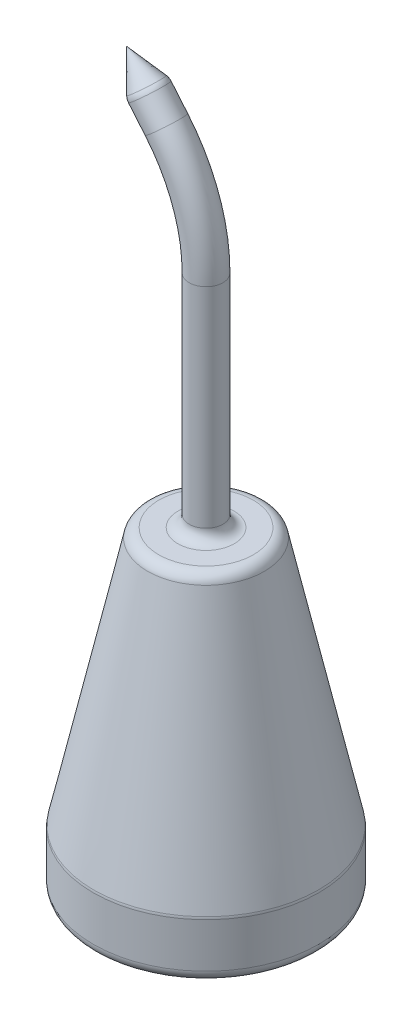
ISO-10303-21;
HEADER;
FILE_DESCRIPTION(('STEP AP214'),'2;1');
FILE_NAME('part.step','',(''),(''),'','','');
FILE_SCHEMA(('AUTOMOTIVE_DESIGN { 1 0 10303 214 1 1 1 1 }'));
ENDSEC;
DATA;
#1=APPLICATION_CONTEXT('core data for automotive mechanical design processes');
#2=APPLICATION_PROTOCOL_DEFINITION('international standard','automotive_design',2000,#1);
#3=PRODUCT_CONTEXT('',#1,'mechanical');
#4=PRODUCT('Part','Part','',(#3));
#5=PRODUCT_RELATED_PRODUCT_CATEGORY('part','',(#4));
#6=PRODUCT_DEFINITION_FORMATION('','',#4);
#7=PRODUCT_DEFINITION_CONTEXT('part definition',#1,'design');
#8=PRODUCT_DEFINITION('design','',#6,#7);
#9=PRODUCT_DEFINITION_SHAPE('','',#8);
#10=(LENGTH_UNIT() NAMED_UNIT(*) SI_UNIT(.MILLI.,.METRE.));
#11=(NAMED_UNIT(*) PLANE_ANGLE_UNIT() SI_UNIT($,.RADIAN.));
#12=(NAMED_UNIT(*) SI_UNIT($,.STERADIAN.) SOLID_ANGLE_UNIT());
#13=UNCERTAINTY_MEASURE_WITH_UNIT(LENGTH_MEASURE(1.E-05),#10,'distance_accuracy_value','');
#14=(GEOMETRIC_REPRESENTATION_CONTEXT(3) GLOBAL_UNCERTAINTY_ASSIGNED_CONTEXT((#13)) GLOBAL_UNIT_ASSIGNED_CONTEXT((#10,
#11,#12)) REPRESENTATION_CONTEXT('',''));
#15=CARTESIAN_POINT('',(0.,0.,0.));
#16=DIRECTION('',(0.,0.,1.));
#17=DIRECTION('',(1.,0.,0.));
#18=AXIS2_PLACEMENT_3D('',#15,#16,#17);
#19=CARTESIAN_POINT('',(0.,42.,0.));
#20=DIRECTION('',(0.,1.,0.));
#21=DIRECTION('',(0.,0.,1.));
#22=AXIS2_PLACEMENT_3D('',#19,#20,#21);
#23=CYLINDRICAL_SURFACE('',#22,10.);
#24=CARTESIAN_POINT('',(0.,0.,0.));
#25=DIRECTION('',(0.,1.,0.));
#26=DIRECTION('',(0.,0.,1.));
#27=AXIS2_PLACEMENT_3D('',#24,#25,#26);
#28=CIRCLE('',#27,10.);
#29=CARTESIAN_POINT('',(0.,0.,10.));
#30=VERTEX_POINT('',#29);
#31=EDGE_CURVE('E155',#30,#30,#28,.T.);
#32=ORIENTED_EDGE('',*,*,#31,.F.);
#33=EDGE_LOOP('',(#32));
#34=FACE_BOUND('',#33,.T.);
#35=CARTESIAN_POINT('',(0.,30.,0.));
#36=DIRECTION('',(0.,1.,0.));
#37=DIRECTION('',(0.,0.,1.));
#38=AXIS2_PLACEMENT_3D('',#35,#36,#37);
#39=CIRCLE('',#38,10.);
#40=CARTESIAN_POINT('',(0.,30.,10.));
#41=VERTEX_POINT('',#40);
#42=EDGE_CURVE('E150',#41,#41,#39,.T.);
#43=ORIENTED_EDGE('',*,*,#42,.T.);
#44=EDGE_LOOP('',(#43));
#45=FACE_BOUND('',#44,.T.);
#46=ADVANCED_FACE('F32',(#34,#45),#23,.F.);
#47=CARTESIAN_POINT('',(10.,0.,0.));
#48=DIRECTION('',(0.,1.,0.));
#49=DIRECTION('',(0.,0.,1.));
#50=AXIS2_PLACEMENT_3D('',#47,#48,#49);
#51=PLANE('',#50);
#52=CARTESIAN_POINT('',(0.,0.,0.));
#53=DIRECTION('',(0.,1.,0.));
#54=DIRECTION('',(0.,0.,1.));
#55=AXIS2_PLACEMENT_3D('',#52,#53,#54);
#56=CIRCLE('',#55,18.);
#57=CARTESIAN_POINT('',(0.,0.,18.));
#58=VERTEX_POINT('',#57);
#59=EDGE_CURVE('E11',#58,#58,#56,.F.);
#60=ORIENTED_EDGE('',*,*,#59,.T.);
#61=EDGE_LOOP('',(#60));
#62=FACE_BOUND('',#61,.T.);
#63=ORIENTED_EDGE('',*,*,#31,.T.);
#64=EDGE_LOOP('',(#63));
#65=FACE_BOUND('',#64,.T.);
#66=ADVANCED_FACE('F65',(#62,#65),#51,.F.);
#67=CARTESIAN_POINT('',(0.,42.,0.));
#68=DIRECTION('',(0.,1.,0.));
#69=DIRECTION('',(0.,0.,1.));
#70=AXIS2_PLACEMENT_3D('',#67,#68,#69);
#71=CYLINDRICAL_SURFACE('',#70,20.);
#72=CARTESIAN_POINT('',(0.,9.9095460706098,0.));
#73=DIRECTION('',(0.,-1.,0.));
#74=DIRECTION('',(0.,0.,-1.));
#75=AXIS2_PLACEMENT_3D('',#72,#73,#74);
#76=CIRCLE('',#75,20.);
#77=CARTESIAN_POINT('',(0.,9.9095460706098,-20.));
#78=VERTEX_POINT('',#77);
#79=EDGE_CURVE('E39',#78,#78,#76,.T.);
#80=ORIENTED_EDGE('',*,*,#79,.T.);
#81=EDGE_LOOP('',(#80));
#82=FACE_BOUND('',#81,.T.);
#83=CARTESIAN_POINT('',(0.,2.,0.));
#84=DIRECTION('',(0.,1.,0.));
#85=DIRECTION('',(0.,0.,1.));
#86=AXIS2_PLACEMENT_3D('',#83,#84,#85);
#87=CIRCLE('',#86,20.);
#88=CARTESIAN_POINT('',(0.,2.,20.));
#89=VERTEX_POINT('',#88);
#90=EDGE_CURVE('E113',#89,#89,#87,.T.);
#91=ORIENTED_EDGE('',*,*,#90,.T.);
#92=EDGE_LOOP('',(#91));
#93=FACE_BOUND('',#92,.T.);
#94=ADVANCED_FACE('F71',(#82,#93),#71,.T.);
#95=CARTESIAN_POINT('',(0.,10.125,0.));
#96=DIRECTION('',(0.,-1.,0.));
#97=DIRECTION('',(0.,0.,-1.));
#98=AXIS2_PLACEMENT_3D('',#95,#96,#97);
#99=CONICAL_SURFACE('',#98,20.,0.214626230387363);
#100=CARTESIAN_POINT('',(0.,10.3355105692461,0.));
#101=DIRECTION('',(0.,1.,0.));
#102=DIRECTION('',(0.,0.,1.));
#103=AXIS2_PLACEMENT_3D('',#100,#101,#102);
#104=CIRCLE('',#103,19.954112137494);
#105=CARTESIAN_POINT('',(0.,10.3355105692461,19.954112137494));
#106=VERTEX_POINT('',#105);
#107=EDGE_CURVE('E110',#106,#106,#104,.T.);
#108=ORIENTED_EDGE('',*,*,#107,.T.);
#109=EDGE_LOOP('',(#108));
#110=FACE_BOUND('',#109,.T.);
#111=CARTESIAN_POINT('',(0.,54.4259644986363,0.));
#112=DIRECTION('',(0.,1.,0.));
#113=DIRECTION('',(0.,0.,1.));
#114=AXIS2_PLACEMENT_3D('',#111,#112,#113);
#115=CIRCLE('',#114,10.3431140057469);
#116=CARTESIAN_POINT('',(0.,54.4259644986363,10.3431140057469));
#117=VERTEX_POINT('',#116);
#118=EDGE_CURVE('E94',#117,#117,#115,.F.);
#119=ORIENTED_EDGE('',*,*,#118,.T.);
#120=EDGE_LOOP('',(#119));
#121=FACE_BOUND('',#120,.T.);
#122=ADVANCED_FACE('F122',(#110,#121),#99,.T.);
#123=CARTESIAN_POINT('',(10.,56.,0.));
#124=DIRECTION('',(0.,-1.,0.));
#125=DIRECTION('',(0.,0.,-1.));
#126=AXIS2_PLACEMENT_3D('',#123,#124,#125);
#127=PLANE('',#126);
#128=CARTESIAN_POINT('',(0.,56.,0.));
#129=DIRECTION('',(0.,-1.,0.));
#130=DIRECTION('',(0.,0.,-1.));
#131=AXIS2_PLACEMENT_3D('',#128,#129,#130);
#132=CIRCLE('',#131,5.);
#133=CARTESIAN_POINT('',(0.,56.,-5.));
#134=VERTEX_POINT('',#133);
#135=EDGE_CURVE('E99',#134,#134,#132,.T.);
#136=ORIENTED_EDGE('',*,*,#135,.T.);
#137=EDGE_LOOP('',(#136));
#138=FACE_BOUND('',#137,.T.);
#139=CARTESIAN_POINT('',(0.,56.,0.));
#140=DIRECTION('',(0.,-1.,0.));
#141=DIRECTION('',(0.,0.,-1.));
#142=AXIS2_PLACEMENT_3D('',#139,#140,#141);
#143=CIRCLE('',#142,8.38900186825282);
#144=CARTESIAN_POINT('',(0.,56.,-8.38900186825282));
#145=VERTEX_POINT('',#144);
#146=EDGE_CURVE('E97',#145,#145,#143,.F.);
#147=ORIENTED_EDGE('',*,*,#146,.T.);
#148=EDGE_LOOP('',(#147));
#149=FACE_BOUND('',#148,.T.);
#150=ADVANCED_FACE('F125',(#138,#149),#127,.F.);
#151=CARTESIAN_POINT('',(0.,30.,0.));
#152=DIRECTION('',(0.,1.,0.));
#153=DIRECTION('',(0.,0.,1.));
#154=AXIS2_PLACEMENT_3D('',#151,#152,#153);
#155=PLANE('',#154);
#156=ORIENTED_EDGE('',*,*,#42,.F.);
#157=EDGE_LOOP('',(#156));
#158=FACE_BOUND('',#157,.T.);
#159=ADVANCED_FACE('F59',(#158),#155,.F.);
#160=CARTESIAN_POINT('',(0.,56.,0.));
#161=DIRECTION('',(0.,1.,0.));
#162=DIRECTION('',(0.,0.,1.));
#163=AXIS2_PLACEMENT_3D('',#160,#161,#162);
#164=CYLINDRICAL_SURFACE('',#163,3.);
#165=CARTESIAN_POINT('',(0.,58.,0.));
#166=DIRECTION('',(0.,-1.,0.));
#167=DIRECTION('',(0.,0.,-1.));
#168=AXIS2_PLACEMENT_3D('',#165,#166,#167);
#169=CIRCLE('',#168,3.);
#170=CARTESIAN_POINT('',(0.,58.,-3.));
#171=VERTEX_POINT('',#170);
#172=EDGE_CURVE('E100',#171,#171,#169,.F.);
#173=ORIENTED_EDGE('',*,*,#172,.T.);
#174=EDGE_LOOP('',(#173));
#175=FACE_BOUND('',#174,.T.);
#176=CARTESIAN_POINT('',(0.,95.080892972014,0.));
#177=DIRECTION('',(0.,1.,0.));
#178=DIRECTION('',(0.,0.,1.));
#179=AXIS2_PLACEMENT_3D('',#176,#177,#178);
#180=CIRCLE('',#179,3.);
#181=CARTESIAN_POINT('',(3.00000000000017,95.080892972014,0.));
#182=VERTEX_POINT('',#181);
#183=EDGE_CURVE('E147',#182,#182,#180,.T.);
#184=ORIENTED_EDGE('',*,*,#183,.F.);
#185=EDGE_LOOP('',(#184));
#186=FACE_BOUND('',#185,.T.);
#187=ADVANCED_FACE('F48',(#175,#186),#164,.T.);
#188=CARTESIAN_POINT('',(-30.,95.0808929720139,0.));
#189=DIRECTION('',(0.,0.,1.));
#190=DIRECTION('',(1.,0.,0.));
#191=AXIS2_PLACEMENT_3D('',#188,#189,#190);
#192=TOROIDAL_SURFACE('',#191,30.0000000000002,3.);
#193=CARTESIAN_POINT('',(-7.01866670643061,114.36452126261,0.));
#194=DIRECTION('',(-0.642787609686538,0.766044443118979,0.));
#195=DIRECTION('',(0.,0.,1.));
#196=AXIS2_PLACEMENT_3D('',#193,#194,#195);
#197=CIRCLE('',#196,3.);
#198=CARTESIAN_POINT('',(-4.72053337707354,116.29288409167,0.));
#199=VERTEX_POINT('',#198);
#200=EDGE_CURVE('E144',#199,#199,#197,.T.);
#201=CARTESIAN_POINT('',(-30.,95.0808929720139,0.));
#202=DIRECTION('',(0.,0.,1.));
#203=DIRECTION('',(1.,0.,0.));
#204=AXIS2_PLACEMENT_3D('',#201,#202,#203);
#205=CIRCLE('',#204,33.0000000000002);
#206=EDGE_CURVE('',#182,#199,#205,.T.);
#207=ORIENTED_EDGE('',*,*,#183,.T.);
#208=ORIENTED_EDGE('',*,*,#200,.F.);
#209=ORIENTED_EDGE('',*,*,#206,.T.);
#210=ORIENTED_EDGE('',*,*,#206,.F.);
#211=EDGE_LOOP('',(#207,#209,#208,#210));
#212=FACE_BOUND('',#211,.T.);
#213=ADVANCED_FACE('F56',(#212),#192,.T.);
#214=CARTESIAN_POINT('',(-7.01866670643058,114.36452126261,0.));
#215=DIRECTION('',(-0.642787609686538,0.766044443118979,0.));
#216=DIRECTION('',(-0.766044443118979,-0.642787609686538,0.));
#217=AXIS2_PLACEMENT_3D('',#214,#215,#216);
#218=CYLINDRICAL_SURFACE('',#217,3.);
#219=CARTESIAN_POINT('',(-9.98111861302334,117.89503396518,0.));
#220=DIRECTION('',(0.642787609686538,-0.766044443118979,0.));
#221=DIRECTION('',(0.766044443118979,0.642787609686538,0.));
#222=AXIS2_PLACEMENT_3D('',#219,#220,#221);
#223=CIRCLE('',#222,3.);
#224=CARTESIAN_POINT('',(-7.6829852836664,119.823396794239,0.));
#225=VERTEX_POINT('',#224);
#226=EDGE_CURVE('E105',#225,#225,#223,.T.);
#227=ORIENTED_EDGE('',*,*,#226,.T.);
#228=EDGE_LOOP('',(#227));
#229=FACE_BOUND('',#228,.T.);
#230=ORIENTED_EDGE('',*,*,#200,.T.);
#231=EDGE_LOOP('',(#230));
#232=FACE_BOUND('',#231,.T.);
#233=ADVANCED_FACE('F45',(#229,#232),#218,.T.);
#234=CARTESIAN_POINT('',(-10.2846017549846,118.256711089904,0.));
#235=DIRECTION('',(0.642787609686538,-0.766044443118979,0.));
#236=DIRECTION('',(0.766044443118979,0.642787609686538,0.));
#237=AXIS2_PLACEMENT_3D('',#234,#235,#236);
#238=CONICAL_SURFACE('',#237,3.,0.463647609000806);
#239=CARTESIAN_POINT('',(-10.5560453291648,118.58020494462,0.));
#240=DIRECTION('',(0.642787609686538,-0.766044443118979,0.));
#241=DIRECTION('',(0.766044443118979,0.642787609686538,0.));
#242=AXIS2_PLACEMENT_3D('',#239,#240,#241);
#243=CIRCLE('',#242,2.78885438199983);
#244=CARTESIAN_POINT('',(-8.41965892716583,120.372845986589,0.));
#245=VERTEX_POINT('',#244);
#246=EDGE_CURVE('E158',#245,#245,#243,.F.);
#247=ORIENTED_EDGE('',*,*,#246,.T.);
#248=EDGE_LOOP('',(#247));
#249=FACE_BOUND('',#248,.T.);
#250=CARTESIAN_POINT('',(-14.1413274131038,122.852977748618,0.));
#251=VERTEX_POINT('',#250);
#252=VERTEX_LOOP('',#251);
#253=FACE_BOUND('',#252,.T.);
#254=ADVANCED_FACE('F42',(#249,#253),#238,.T.);
#255=CARTESIAN_POINT('',(-9.98111861302334,117.89503396518,0.));
#256=DIRECTION('',(0.642787609686538,-0.766044443118979,0.));
#257=DIRECTION('',(0.766044443118979,0.642787609686538,0.));
#258=AXIS2_PLACEMENT_3D('',#255,#256,#257);
#259=DEGENERATE_TOROIDAL_SURFACE('',#258,1.,2.,.T.);
#260=ORIENTED_EDGE('',*,*,#226,.F.);
#261=EDGE_LOOP('',(#260));
#262=FACE_BOUND('',#261,.T.);
#263=ORIENTED_EDGE('',*,*,#246,.F.);
#264=EDGE_LOOP('',(#263));
#265=FACE_BOUND('',#264,.T.);
#266=ADVANCED_FACE('F44',(#262,#265),#259,.T.);
#267=CARTESIAN_POINT('',(0.,58.,0.));
#268=DIRECTION('',(0.,-1.,0.));
#269=DIRECTION('',(0.,0.,-1.));
#270=AXIS2_PLACEMENT_3D('',#267,#268,#269);
#271=TOROIDAL_SURFACE('',#270,5.,2.);
#272=ORIENTED_EDGE('',*,*,#135,.F.);
#273=EDGE_LOOP('',(#272));
#274=FACE_BOUND('',#273,.T.);
#275=ORIENTED_EDGE('',*,*,#172,.F.);
#276=EDGE_LOOP('',(#275));
#277=FACE_BOUND('',#276,.T.);
#278=ADVANCED_FACE('F53',(#274,#277),#271,.F.);
#279=CARTESIAN_POINT('',(0.,9.9095460706098,0.));
#280=DIRECTION('',(0.,-1.,0.));
#281=DIRECTION('',(0.,0.,-1.));
#282=AXIS2_PLACEMENT_3D('',#279,#280,#281);
#283=TOROIDAL_SURFACE('',#282,18.,2.);
#284=ORIENTED_EDGE('',*,*,#79,.F.);
#285=EDGE_LOOP('',(#284));
#286=FACE_BOUND('',#285,.T.);
#287=ORIENTED_EDGE('',*,*,#107,.F.);
#288=EDGE_LOOP('',(#287));
#289=FACE_BOUND('',#288,.T.);
#290=ADVANCED_FACE('F80',(#286,#289),#283,.T.);
#291=CARTESIAN_POINT('',(0.,54.,0.));
#292=DIRECTION('',(0.,-1.,0.));
#293=DIRECTION('',(0.,0.,-1.));
#294=AXIS2_PLACEMENT_3D('',#291,#292,#293);
#295=TOROIDAL_SURFACE('',#294,8.38900186825282,2.);
#296=ORIENTED_EDGE('',*,*,#118,.F.);
#297=EDGE_LOOP('',(#296));
#298=FACE_BOUND('',#297,.T.);
#299=ORIENTED_EDGE('',*,*,#146,.F.);
#300=EDGE_LOOP('',(#299));
#301=FACE_BOUND('',#300,.T.);
#302=ADVANCED_FACE('F83',(#298,#301),#295,.T.);
#303=CARTESIAN_POINT('',(0.,2.,0.));
#304=DIRECTION('',(0.,1.,0.));
#305=DIRECTION('',(0.,0.,1.));
#306=AXIS2_PLACEMENT_3D('',#303,#304,#305);
#307=TOROIDAL_SURFACE('',#306,18.,2.);
#308=ORIENTED_EDGE('',*,*,#59,.F.);
#309=EDGE_LOOP('',(#308));
#310=FACE_BOUND('',#309,.T.);
#311=ORIENTED_EDGE('',*,*,#90,.F.);
#312=EDGE_LOOP('',(#311));
#313=FACE_BOUND('',#312,.T.);
#314=ADVANCED_FACE('F34',(#310,#313),#307,.T.);
#315=CLOSED_SHELL('',(#46,#66,#94,#122,#150,#159,#187,#213,#233,#254,#266,#278,#290,#302,#314));
#316=MANIFOLD_SOLID_BREP('B2',#315);
#317=ADVANCED_BREP_SHAPE_REPRESENTATION('',(#18,#316),#14);
#318=SHAPE_DEFINITION_REPRESENTATION(#9,#317);
ENDSEC;
END-ISO-10303-21;
